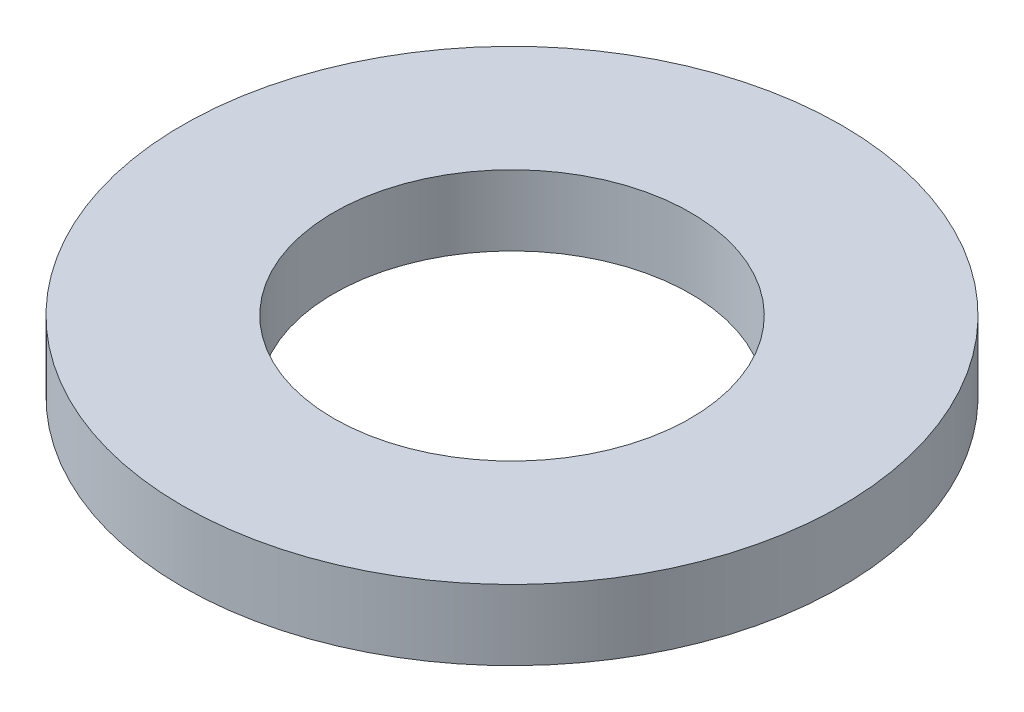
ISO-10303-21;
HEADER;
FILE_DESCRIPTION(('STEP AP214'),'2;1');
FILE_NAME('part.step','',(''),(''),'','','');
FILE_SCHEMA(('AUTOMOTIVE_DESIGN { 1 0 10303 214 1 1 1 1 }'));
ENDSEC;
DATA;
#1=APPLICATION_CONTEXT('core data for automotive mechanical design processes');
#2=APPLICATION_PROTOCOL_DEFINITION('international standard','automotive_design',2000,#1);
#3=PRODUCT_CONTEXT('',#1,'mechanical');
#4=PRODUCT('Part','Part','',(#3));
#5=PRODUCT_RELATED_PRODUCT_CATEGORY('part','',(#4));
#6=PRODUCT_DEFINITION_FORMATION('','',#4);
#7=PRODUCT_DEFINITION_CONTEXT('part definition',#1,'design');
#8=PRODUCT_DEFINITION('design','',#6,#7);
#9=PRODUCT_DEFINITION_SHAPE('','',#8);
#10=(LENGTH_UNIT() NAMED_UNIT(*) SI_UNIT(.MILLI.,.METRE.));
#11=(NAMED_UNIT(*) PLANE_ANGLE_UNIT() SI_UNIT($,.RADIAN.));
#12=(NAMED_UNIT(*) SI_UNIT($,.STERADIAN.) SOLID_ANGLE_UNIT());
#13=UNCERTAINTY_MEASURE_WITH_UNIT(LENGTH_MEASURE(1.E-05),#10,'distance_accuracy_value','');
#14=(GEOMETRIC_REPRESENTATION_CONTEXT(3) GLOBAL_UNCERTAINTY_ASSIGNED_CONTEXT((#13)) GLOBAL_UNIT_ASSIGNED_CONTEXT((#10,
#11,#12)) REPRESENTATION_CONTEXT('',''));
#15=CARTESIAN_POINT('',(0.,0.,0.));
#16=DIRECTION('',(0.,0.,1.));
#17=DIRECTION('',(1.,0.,0.));
#18=AXIS2_PLACEMENT_3D('',#15,#16,#17);
#19=CARTESIAN_POINT('',(0.,2.032,0.));
#20=DIRECTION('',(0.,-1.,0.));
#21=DIRECTION('',(0.,0.,-1.));
#22=AXIS2_PLACEMENT_3D('',#19,#20,#21);
#23=CYLINDRICAL_SURFACE('',#22,9.525);
#24=CARTESIAN_POINT('',(0.,2.032,0.));
#25=DIRECTION('',(0.,1.,0.));
#26=DIRECTION('',(0.,0.,1.));
#27=AXIS2_PLACEMENT_3D('',#24,#25,#26);
#28=CIRCLE('',#27,9.525);
#29=CARTESIAN_POINT('',(0.,2.032,9.525));
#30=VERTEX_POINT('',#29);
#31=EDGE_CURVE('E10',#30,#30,#28,.T.);
#32=ORIENTED_EDGE('',*,*,#31,.F.);
#33=EDGE_LOOP('',(#32));
#34=FACE_BOUND('',#33,.T.);
#35=CARTESIAN_POINT('',(0.,0.,0.));
#36=DIRECTION('',(0.,1.,0.));
#37=DIRECTION('',(0.,0.,1.));
#38=AXIS2_PLACEMENT_3D('',#35,#36,#37);
#39=CIRCLE('',#38,9.525);
#40=CARTESIAN_POINT('',(0.,0.,9.525));
#41=VERTEX_POINT('',#40);
#42=EDGE_CURVE('E34',#41,#41,#39,.T.);
#43=ORIENTED_EDGE('',*,*,#42,.T.);
#44=EDGE_LOOP('',(#43));
#45=FACE_BOUND('',#44,.T.);
#46=ADVANCED_FACE('F31',(#34,#45),#23,.T.);
#47=CARTESIAN_POINT('',(0.,2.032,0.));
#48=DIRECTION('',(0.,1.,0.));
#49=DIRECTION('',(0.,0.,1.));
#50=AXIS2_PLACEMENT_3D('',#47,#48,#49);
#51=PLANE('',#50);
#52=CARTESIAN_POINT('',(0.,2.032,0.));
#53=DIRECTION('',(0.,1.,0.));
#54=DIRECTION('',(0.,0.,1.));
#55=AXIS2_PLACEMENT_3D('',#52,#53,#54);
#56=CIRCLE('',#55,5.1562);
#57=CARTESIAN_POINT('',(0.,2.032,5.1562));
#58=VERTEX_POINT('',#57);
#59=EDGE_CURVE('E43',#58,#58,#56,.T.);
#60=ORIENTED_EDGE('',*,*,#59,.F.);
#61=EDGE_LOOP('',(#60));
#62=FACE_BOUND('',#61,.T.);
#63=ORIENTED_EDGE('',*,*,#31,.T.);
#64=EDGE_LOOP('',(#63));
#65=FACE_BOUND('',#64,.T.);
#66=ADVANCED_FACE('F58',(#62,#65),#51,.T.);
#67=CARTESIAN_POINT('',(0.,0.,0.));
#68=DIRECTION('',(0.,1.,0.));
#69=DIRECTION('',(0.,0.,1.));
#70=AXIS2_PLACEMENT_3D('',#67,#68,#69);
#71=PLANE('',#70);
#72=CARTESIAN_POINT('',(0.,0.,0.));
#73=DIRECTION('',(0.,1.,0.));
#74=DIRECTION('',(0.,0.,1.));
#75=AXIS2_PLACEMENT_3D('',#72,#73,#74);
#76=CIRCLE('',#75,5.1562);
#77=CARTESIAN_POINT('',(0.,0.,5.1562));
#78=VERTEX_POINT('',#77);
#79=EDGE_CURVE('E41',#78,#78,#76,.T.);
#80=ORIENTED_EDGE('',*,*,#79,.T.);
#81=EDGE_LOOP('',(#80));
#82=FACE_BOUND('',#81,.T.);
#83=ORIENTED_EDGE('',*,*,#42,.F.);
#84=EDGE_LOOP('',(#83));
#85=FACE_BOUND('',#84,.T.);
#86=ADVANCED_FACE('F49',(#82,#85),#71,.F.);
#87=CARTESIAN_POINT('',(0.,0.,0.));
#88=DIRECTION('',(0.,1.,0.));
#89=DIRECTION('',(0.,0.,1.));
#90=AXIS2_PLACEMENT_3D('',#87,#88,#89);
#91=CYLINDRICAL_SURFACE('',#90,5.1562);
#92=ORIENTED_EDGE('',*,*,#79,.F.);
#93=EDGE_LOOP('',(#92));
#94=FACE_BOUND('',#93,.T.);
#95=ORIENTED_EDGE('',*,*,#59,.T.);
#96=EDGE_LOOP('',(#95));
#97=FACE_BOUND('',#96,.T.);
#98=ADVANCED_FACE('F52',(#94,#97),#91,.F.);
#99=CLOSED_SHELL('',(#46,#66,#86,#98));
#100=MANIFOLD_SOLID_BREP('B2',#99);
#101=ADVANCED_BREP_SHAPE_REPRESENTATION('',(#18,#100),#14);
#102=SHAPE_DEFINITION_REPRESENTATION(#9,#101);
ENDSEC;
END-ISO-10303-21;
